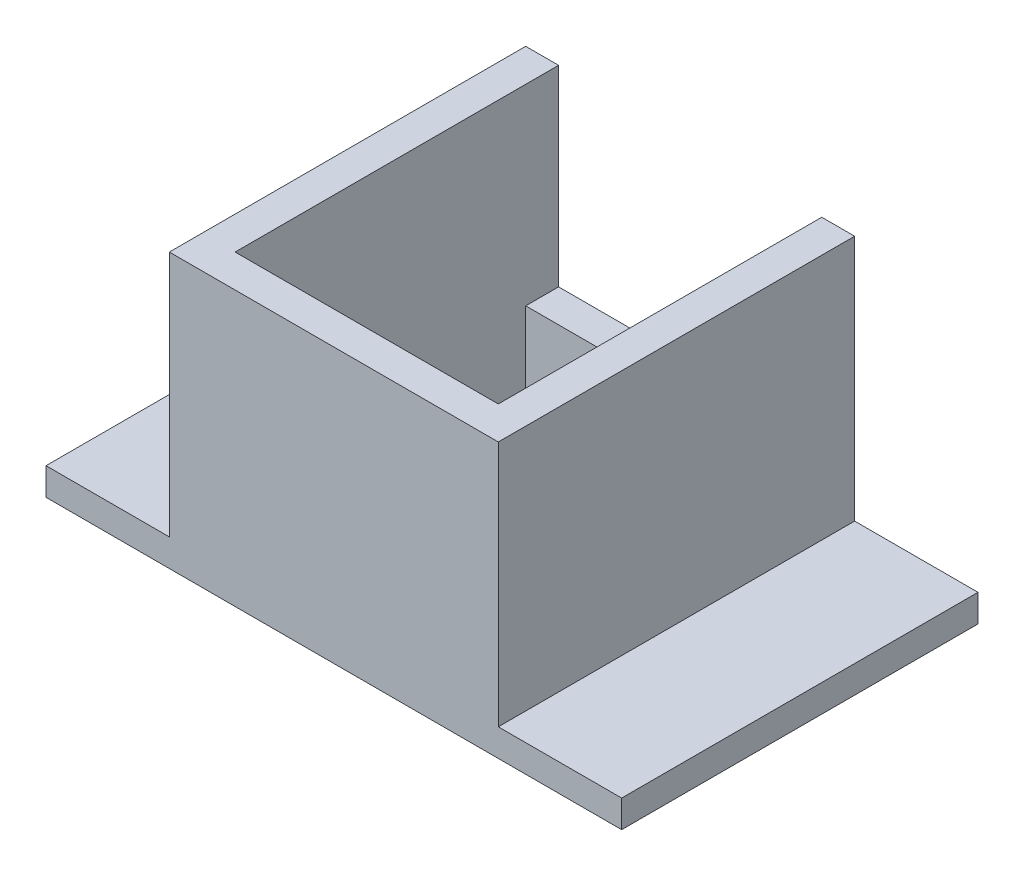
ISO-10303-21;
HEADER;
FILE_DESCRIPTION(('STEP AP214'),'2;1');
FILE_NAME('part.step','',(''),(''),'','','');
FILE_SCHEMA(('AUTOMOTIVE_DESIGN { 1 0 10303 214 1 1 1 1 }'));
ENDSEC;
DATA;
#1=APPLICATION_CONTEXT('core data for automotive mechanical design processes');
#2=APPLICATION_PROTOCOL_DEFINITION('international standard','automotive_design',2000,#1);
#3=PRODUCT_CONTEXT('',#1,'mechanical');
#4=PRODUCT('Part','Part','',(#3));
#5=PRODUCT_RELATED_PRODUCT_CATEGORY('part','',(#4));
#6=PRODUCT_DEFINITION_FORMATION('','',#4);
#7=PRODUCT_DEFINITION_CONTEXT('part definition',#1,'design');
#8=PRODUCT_DEFINITION('design','',#6,#7);
#9=PRODUCT_DEFINITION_SHAPE('','',#8);
#10=(LENGTH_UNIT() NAMED_UNIT(*) SI_UNIT(.MILLI.,.METRE.));
#11=(NAMED_UNIT(*) PLANE_ANGLE_UNIT() SI_UNIT($,.RADIAN.));
#12=(NAMED_UNIT(*) SI_UNIT($,.STERADIAN.) SOLID_ANGLE_UNIT());
#13=UNCERTAINTY_MEASURE_WITH_UNIT(LENGTH_MEASURE(1.E-05),#10,'distance_accuracy_value','');
#14=(GEOMETRIC_REPRESENTATION_CONTEXT(3) GLOBAL_UNCERTAINTY_ASSIGNED_CONTEXT((#13)) GLOBAL_UNIT_ASSIGNED_CONTEXT((#10,
#11,#12)) REPRESENTATION_CONTEXT('',''));
#15=CARTESIAN_POINT('',(0.,0.,0.));
#16=DIRECTION('',(0.,0.,1.));
#17=DIRECTION('',(1.,0.,0.));
#18=AXIS2_PLACEMENT_3D('',#15,#16,#17);
#19=CARTESIAN_POINT('',(-4.8,10.,-5.3));
#20=DIRECTION('',(0.,0.,1.));
#21=DIRECTION('',(1.,0.,0.));
#22=AXIS2_PLACEMENT_3D('',#19,#20,#21);
#23=PLANE('',#22);
#24=DIRECTION('',(0.,-1.,0.));
#25=VECTOR('',#24,1.);
#26=CARTESIAN_POINT('',(4.8,10.,-5.3));
#27=LINE('',#26,#25);
#28=CARTESIAN_POINT('',(4.8,3.,-5.3));
#29=VERTEX_POINT('',#28);
#30=CARTESIAN_POINT('',(4.8,0.,-5.3));
#31=VERTEX_POINT('',#30);
#32=EDGE_CURVE('E204',#29,#31,#27,.T.);
#33=ORIENTED_EDGE('',*,*,#32,.F.);
#34=DIRECTION('',(1.,0.,0.));
#35=VECTOR('',#34,1.);
#36=CARTESIAN_POINT('',(-4.8,3.,-5.3));
#37=LINE('',#36,#35);
#38=CARTESIAN_POINT('',(-4.8,3.,-5.3));
#39=VERTEX_POINT('',#38);
#40=EDGE_CURVE('E48',#39,#29,#37,.T.);
#41=ORIENTED_EDGE('',*,*,#40,.F.);
#42=DIRECTION('',(0.,-1.,0.));
#43=VECTOR('',#42,1.);
#44=CARTESIAN_POINT('',(-4.8,10.,-5.3));
#45=LINE('',#44,#43);
#46=CARTESIAN_POINT('',(-4.8,0.,-5.3));
#47=VERTEX_POINT('',#46);
#48=EDGE_CURVE('E220',#39,#47,#45,.T.);
#49=ORIENTED_EDGE('',*,*,#48,.T.);
#50=DIRECTION('',(-1.,0.,0.));
#51=VECTOR('',#50,1.);
#52=CARTESIAN_POINT('',(-4.8,0.,-5.3));
#53=LINE('',#52,#51);
#54=EDGE_CURVE('E196',#31,#47,#53,.T.);
#55=ORIENTED_EDGE('',*,*,#54,.F.);
#56=EDGE_LOOP('',(#33,#41,#49,#55));
#57=FACE_BOUND('',#56,.T.);
#58=ADVANCED_FACE('F33',(#57),#23,.T.);
#59=CARTESIAN_POINT('',(6.,10.,-6.5));
#60=DIRECTION('',(-1.,0.,0.));
#61=DIRECTION('',(0.,0.,1.));
#62=AXIS2_PLACEMENT_3D('',#59,#60,#61);
#63=PLANE('',#62);
#64=DIRECTION('',(0.,0.,1.));
#65=VECTOR('',#64,1.);
#66=CARTESIAN_POINT('',(6.,1.,-6.5));
#67=LINE('',#66,#65);
#68=CARTESIAN_POINT('',(6.,0.999999999999999,-6.5));
#69=VERTEX_POINT('',#68);
#70=CARTESIAN_POINT('',(6.,1.,6.5));
#71=VERTEX_POINT('',#70);
#72=EDGE_CURVE('E56',#69,#71,#67,.T.);
#73=ORIENTED_EDGE('',*,*,#72,.F.);
#74=DIRECTION('',(0.,-1.,0.));
#75=VECTOR('',#74,1.);
#76=CARTESIAN_POINT('',(6.,10.,-6.5));
#77=LINE('',#76,#75);
#78=CARTESIAN_POINT('',(6.,10.,-6.5));
#79=VERTEX_POINT('',#78);
#80=EDGE_CURVE('E11',#79,#69,#77,.T.);
#81=ORIENTED_EDGE('',*,*,#80,.F.);
#82=DIRECTION('',(0.,0.,-1.));
#83=VECTOR('',#82,1.);
#84=CARTESIAN_POINT('',(6.,10.,-6.5));
#85=LINE('',#84,#83);
#86=CARTESIAN_POINT('',(6.,10.,6.5));
#87=VERTEX_POINT('',#86);
#88=EDGE_CURVE('E223',#87,#79,#85,.T.);
#89=ORIENTED_EDGE('',*,*,#88,.F.);
#90=DIRECTION('',(0.,-1.,0.));
#91=VECTOR('',#90,1.);
#92=CARTESIAN_POINT('',(6.,10.,6.5));
#93=LINE('',#92,#91);
#94=EDGE_CURVE('E234',#87,#71,#93,.T.);
#95=ORIENTED_EDGE('',*,*,#94,.T.);
#96=EDGE_LOOP('',(#73,#81,#89,#95));
#97=FACE_BOUND('',#96,.T.);
#98=ADVANCED_FACE('F35',(#97),#63,.F.);
#99=CARTESIAN_POINT('',(-6.,10.,-6.5));
#100=DIRECTION('',(1.,0.,0.));
#101=DIRECTION('',(0.,0.,-1.));
#102=AXIS2_PLACEMENT_3D('',#99,#100,#101);
#103=PLANE('',#102);
#104=DIRECTION('',(0.,0.,-1.));
#105=VECTOR('',#104,1.);
#106=CARTESIAN_POINT('',(-6.,1.,-6.5));
#107=LINE('',#106,#105);
#108=CARTESIAN_POINT('',(-6.,0.999999999999999,6.5));
#109=VERTEX_POINT('',#108);
#110=CARTESIAN_POINT('',(-6.,1.,-6.5));
#111=VERTEX_POINT('',#110);
#112=EDGE_CURVE('E178',#109,#111,#107,.T.);
#113=ORIENTED_EDGE('',*,*,#112,.F.);
#114=DIRECTION('',(0.,-1.,0.));
#115=VECTOR('',#114,1.);
#116=CARTESIAN_POINT('',(-6.,10.,6.5));
#117=LINE('',#116,#115);
#118=CARTESIAN_POINT('',(-6.,10.,6.5));
#119=VERTEX_POINT('',#118);
#120=EDGE_CURVE('E238',#119,#109,#117,.T.);
#121=ORIENTED_EDGE('',*,*,#120,.F.);
#122=DIRECTION('',(0.,0.,1.));
#123=VECTOR('',#122,1.);
#124=CARTESIAN_POINT('',(-6.,10.,-6.5));
#125=LINE('',#124,#123);
#126=CARTESIAN_POINT('',(-6.,10.,-6.5));
#127=VERTEX_POINT('',#126);
#128=EDGE_CURVE('E230',#127,#119,#125,.T.);
#129=ORIENTED_EDGE('',*,*,#128,.F.);
#130=DIRECTION('',(0.,-1.,0.));
#131=VECTOR('',#130,1.);
#132=CARTESIAN_POINT('',(-6.,10.,-6.5));
#133=LINE('',#132,#131);
#134=EDGE_CURVE('E41',#127,#111,#133,.T.);
#135=ORIENTED_EDGE('',*,*,#134,.T.);
#136=EDGE_LOOP('',(#113,#121,#129,#135));
#137=FACE_BOUND('',#136,.T.);
#138=ADVANCED_FACE('F244',(#137),#103,.F.);
#139=CARTESIAN_POINT('',(0.,10.,0.));
#140=DIRECTION('',(0.,1.,0.));
#141=DIRECTION('',(0.,0.,1.));
#142=AXIS2_PLACEMENT_3D('',#139,#140,#141);
#143=PLANE('',#142);
#144=DIRECTION('',(0.,0.,1.));
#145=VECTOR('',#144,1.);
#146=CARTESIAN_POINT('',(-4.8,10.,-5.3));
#147=LINE('',#146,#145);
#148=CARTESIAN_POINT('',(-4.8,10.,-6.5));
#149=VERTEX_POINT('',#148);
#150=CARTESIAN_POINT('',(-4.8,10.,5.3));
#151=VERTEX_POINT('',#150);
#152=EDGE_CURVE('E197',#149,#151,#147,.T.);
#153=ORIENTED_EDGE('',*,*,#152,.F.);
#154=DIRECTION('',(-1.,0.,0.));
#155=VECTOR('',#154,1.);
#156=CARTESIAN_POINT('',(-6.,10.,-6.5));
#157=LINE('',#156,#155);
#158=EDGE_CURVE('E226',#149,#127,#157,.T.);
#159=ORIENTED_EDGE('',*,*,#158,.T.);
#160=ORIENTED_EDGE('',*,*,#128,.T.);
#161=DIRECTION('',(1.,0.,0.));
#162=VECTOR('',#161,1.);
#163=CARTESIAN_POINT('',(-6.,10.,6.5));
#164=LINE('',#163,#162);
#165=EDGE_CURVE('E232',#119,#87,#164,.T.);
#166=ORIENTED_EDGE('',*,*,#165,.T.);
#167=ORIENTED_EDGE('',*,*,#88,.T.);
#168=CARTESIAN_POINT('',(4.8,10.,-6.5));
#169=VERTEX_POINT('',#168);
#170=EDGE_CURVE('E228',#79,#169,#157,.T.);
#171=ORIENTED_EDGE('',*,*,#170,.T.);
#172=DIRECTION('',(0.,0.,-1.));
#173=VECTOR('',#172,1.);
#174=CARTESIAN_POINT('',(4.8,10.,-5.3));
#175=LINE('',#174,#173);
#176=CARTESIAN_POINT('',(4.80000000000001,10.,5.3));
#177=VERTEX_POINT('',#176);
#178=EDGE_CURVE('E140',#177,#169,#175,.T.);
#179=ORIENTED_EDGE('',*,*,#178,.F.);
#180=DIRECTION('',(1.,0.,0.));
#181=VECTOR('',#180,1.);
#182=CARTESIAN_POINT('',(-4.8,10.,5.3));
#183=LINE('',#182,#181);
#184=EDGE_CURVE('E199',#151,#177,#183,.T.);
#185=ORIENTED_EDGE('',*,*,#184,.F.);
#186=EDGE_LOOP('',(#153,#159,#160,#166,#167,#171,#179,#185));
#187=FACE_BOUND('',#186,.T.);
#188=ADVANCED_FACE('F259',(#187),#143,.T.);
#189=CARTESIAN_POINT('',(0.,0.,0.));
#190=DIRECTION('',(0.,1.,0.));
#191=DIRECTION('',(0.,0.,1.));
#192=AXIS2_PLACEMENT_3D('',#189,#190,#191);
#193=PLANE('',#192);
#194=DIRECTION('',(-1.,0.,0.));
#195=VECTOR('',#194,1.);
#196=CARTESIAN_POINT('',(-6.,0.,-6.5));
#197=LINE('',#196,#195);
#198=CARTESIAN_POINT('',(10.5,0.,-6.5));
#199=VERTEX_POINT('',#198);
#200=CARTESIAN_POINT('',(-10.5,0.,-6.5));
#201=VERTEX_POINT('',#200);
#202=EDGE_CURVE('E222',#199,#201,#197,.T.);
#203=ORIENTED_EDGE('',*,*,#202,.F.);
#204=DIRECTION('',(0.,0.,-1.));
#205=VECTOR('',#204,1.);
#206=CARTESIAN_POINT('',(10.5,0.,6.5));
#207=LINE('',#206,#205);
#208=CARTESIAN_POINT('',(10.5,0.,6.5));
#209=VERTEX_POINT('',#208);
#210=EDGE_CURVE('E159',#209,#199,#207,.T.);
#211=ORIENTED_EDGE('',*,*,#210,.F.);
#212=DIRECTION('',(1.,0.,0.));
#213=VECTOR('',#212,1.);
#214=CARTESIAN_POINT('',(-6.,0.,6.5));
#215=LINE('',#214,#213);
#216=CARTESIAN_POINT('',(-10.5,0.,6.5));
#217=VERTEX_POINT('',#216);
#218=EDGE_CURVE('E227',#217,#209,#215,.T.);
#219=ORIENTED_EDGE('',*,*,#218,.F.);
#220=DIRECTION('',(0.,0.,1.));
#221=VECTOR('',#220,1.);
#222=CARTESIAN_POINT('',(-10.5,0.,6.5));
#223=LINE('',#222,#221);
#224=EDGE_CURVE('E177',#201,#217,#223,.T.);
#225=ORIENTED_EDGE('',*,*,#224,.F.);
#226=EDGE_LOOP('',(#203,#211,#219,#225));
#227=FACE_BOUND('',#226,.T.);
#228=ORIENTED_EDGE('',*,*,#54,.T.);
#229=DIRECTION('',(0.,0.,1.));
#230=VECTOR('',#229,1.);
#231=CARTESIAN_POINT('',(-4.8,0.,-5.3));
#232=LINE('',#231,#230);
#233=CARTESIAN_POINT('',(-4.8,0.,5.3));
#234=VERTEX_POINT('',#233);
#235=EDGE_CURVE('E207',#47,#234,#232,.T.);
#236=ORIENTED_EDGE('',*,*,#235,.T.);
#237=DIRECTION('',(1.,0.,0.));
#238=VECTOR('',#237,1.);
#239=CARTESIAN_POINT('',(-4.8,0.,5.3));
#240=LINE('',#239,#238);
#241=CARTESIAN_POINT('',(4.80000000000001,0.,5.3));
#242=VERTEX_POINT('',#241);
#243=EDGE_CURVE('E210',#234,#242,#240,.T.);
#244=ORIENTED_EDGE('',*,*,#243,.T.);
#245=DIRECTION('',(0.,0.,-1.));
#246=VECTOR('',#245,1.);
#247=CARTESIAN_POINT('',(4.8,0.,-5.3));
#248=LINE('',#247,#246);
#249=EDGE_CURVE('E200',#242,#31,#248,.T.);
#250=ORIENTED_EDGE('',*,*,#249,.T.);
#251=EDGE_LOOP('',(#228,#236,#244,#250));
#252=FACE_BOUND('',#251,.T.);
#253=ADVANCED_FACE('F270',(#227,#252),#193,.F.);
#254=CARTESIAN_POINT('',(-6.,10.,-6.5));
#255=DIRECTION('',(0.,0.,1.));
#256=DIRECTION('',(1.,0.,0.));
#257=AXIS2_PLACEMENT_3D('',#254,#255,#256);
#258=PLANE('',#257);
#259=ORIENTED_EDGE('',*,*,#158,.F.);
#260=DIRECTION('',(0.,1.,0.));
#261=VECTOR('',#260,1.);
#262=CARTESIAN_POINT('',(-4.8,3.,-6.5));
#263=LINE('',#262,#261);
#264=CARTESIAN_POINT('',(-4.8,3.,-6.5));
#265=VERTEX_POINT('',#264);
#266=EDGE_CURVE('E144',#265,#149,#263,.T.);
#267=ORIENTED_EDGE('',*,*,#266,.F.);
#268=DIRECTION('',(-1.,0.,0.));
#269=VECTOR('',#268,1.);
#270=CARTESIAN_POINT('',(4.8,3.,-6.5));
#271=LINE('',#270,#269);
#272=CARTESIAN_POINT('',(4.8,3.,-6.5));
#273=VERTEX_POINT('',#272);
#274=EDGE_CURVE('E148',#273,#265,#271,.T.);
#275=ORIENTED_EDGE('',*,*,#274,.F.);
#276=DIRECTION('',(0.,1.,0.));
#277=VECTOR('',#276,1.);
#278=CARTESIAN_POINT('',(4.8,3.,-6.5));
#279=LINE('',#278,#277);
#280=EDGE_CURVE('E134',#273,#169,#279,.T.);
#281=ORIENTED_EDGE('',*,*,#280,.T.);
#282=ORIENTED_EDGE('',*,*,#170,.F.);
#283=ORIENTED_EDGE('',*,*,#80,.T.);
#284=DIRECTION('',(-1.,0.,0.));
#285=VECTOR('',#284,1.);
#286=CARTESIAN_POINT('',(6.,1.,-6.5));
#287=LINE('',#286,#285);
#288=CARTESIAN_POINT('',(10.5,1.,-6.5));
#289=VERTEX_POINT('',#288);
#290=EDGE_CURVE('E166',#289,#69,#287,.T.);
#291=ORIENTED_EDGE('',*,*,#290,.F.);
#292=DIRECTION('',(0.,-1.,0.));
#293=VECTOR('',#292,1.);
#294=CARTESIAN_POINT('',(10.5,1.,-6.5));
#295=LINE('',#294,#293);
#296=EDGE_CURVE('E169',#289,#199,#295,.T.);
#297=ORIENTED_EDGE('',*,*,#296,.T.);
#298=ORIENTED_EDGE('',*,*,#202,.T.);
#299=DIRECTION('',(0.,-1.,0.));
#300=VECTOR('',#299,1.);
#301=CARTESIAN_POINT('',(-10.5,1.,-6.5));
#302=LINE('',#301,#300);
#303=CARTESIAN_POINT('',(-10.5,1.,-6.5));
#304=VERTEX_POINT('',#303);
#305=EDGE_CURVE('E193',#304,#201,#302,.T.);
#306=ORIENTED_EDGE('',*,*,#305,.F.);
#307=DIRECTION('',(-1.,0.,0.));
#308=VECTOR('',#307,1.);
#309=CARTESIAN_POINT('',(-6.,1.,-6.5));
#310=LINE('',#309,#308);
#311=EDGE_CURVE('E181',#111,#304,#310,.T.);
#312=ORIENTED_EDGE('',*,*,#311,.F.);
#313=ORIENTED_EDGE('',*,*,#134,.F.);
#314=EDGE_LOOP('',(#259,#267,#275,#281,#282,#283,#291,#297,#298,#306,#312,#313));
#315=FACE_BOUND('',#314,.T.);
#316=ADVANCED_FACE('F153',(#315),#258,.F.);
#317=CARTESIAN_POINT('',(-6.,10.,6.5));
#318=DIRECTION('',(0.,0.,-1.));
#319=DIRECTION('',(-1.,0.,0.));
#320=AXIS2_PLACEMENT_3D('',#317,#318,#319);
#321=PLANE('',#320);
#322=ORIENTED_EDGE('',*,*,#218,.T.);
#323=DIRECTION('',(0.,-1.,0.));
#324=VECTOR('',#323,1.);
#325=CARTESIAN_POINT('',(10.5,1.,6.5));
#326=LINE('',#325,#324);
#327=CARTESIAN_POINT('',(10.5,1.,6.5));
#328=VERTEX_POINT('',#327);
#329=EDGE_CURVE('E174',#328,#209,#326,.T.);
#330=ORIENTED_EDGE('',*,*,#329,.F.);
#331=DIRECTION('',(1.,0.,0.));
#332=VECTOR('',#331,1.);
#333=CARTESIAN_POINT('',(6.,1.,6.5));
#334=LINE('',#333,#332);
#335=EDGE_CURVE('E162',#71,#328,#334,.T.);
#336=ORIENTED_EDGE('',*,*,#335,.F.);
#337=ORIENTED_EDGE('',*,*,#94,.F.);
#338=ORIENTED_EDGE('',*,*,#165,.F.);
#339=ORIENTED_EDGE('',*,*,#120,.T.);
#340=DIRECTION('',(1.,0.,0.));
#341=VECTOR('',#340,1.);
#342=CARTESIAN_POINT('',(-6.,1.,6.5));
#343=LINE('',#342,#341);
#344=CARTESIAN_POINT('',(-10.5,1.,6.5));
#345=VERTEX_POINT('',#344);
#346=EDGE_CURVE('E185',#345,#109,#343,.T.);
#347=ORIENTED_EDGE('',*,*,#346,.F.);
#348=DIRECTION('',(0.,-1.,0.));
#349=VECTOR('',#348,1.);
#350=CARTESIAN_POINT('',(-10.5,1.,6.5));
#351=LINE('',#350,#349);
#352=EDGE_CURVE('E188',#345,#217,#351,.T.);
#353=ORIENTED_EDGE('',*,*,#352,.T.);
#354=EDGE_LOOP('',(#322,#330,#336,#337,#338,#339,#347,#353));
#355=FACE_BOUND('',#354,.T.);
#356=ADVANCED_FACE('F253',(#355),#321,.F.);
#357=CARTESIAN_POINT('',(-4.8,10.,-5.3));
#358=DIRECTION('',(1.,0.,0.));
#359=DIRECTION('',(0.,0.,-1.));
#360=AXIS2_PLACEMENT_3D('',#357,#358,#359);
#361=PLANE('',#360);
#362=ORIENTED_EDGE('',*,*,#235,.F.);
#363=ORIENTED_EDGE('',*,*,#48,.F.);
#364=DIRECTION('',(0.,0.,1.));
#365=VECTOR('',#364,1.);
#366=CARTESIAN_POINT('',(-4.8,3.,-5.3));
#367=LINE('',#366,#365);
#368=EDGE_CURVE('E145',#265,#39,#367,.T.);
#369=ORIENTED_EDGE('',*,*,#368,.F.);
#370=ORIENTED_EDGE('',*,*,#266,.T.);
#371=ORIENTED_EDGE('',*,*,#152,.T.);
#372=DIRECTION('',(0.,-1.,0.));
#373=VECTOR('',#372,1.);
#374=CARTESIAN_POINT('',(-4.8,10.,5.3));
#375=LINE('',#374,#373);
#376=EDGE_CURVE('E218',#151,#234,#375,.T.);
#377=ORIENTED_EDGE('',*,*,#376,.T.);
#378=EDGE_LOOP('',(#362,#363,#369,#370,#371,#377));
#379=FACE_BOUND('',#378,.T.);
#380=ADVANCED_FACE('F264',(#379),#361,.T.);
#381=CARTESIAN_POINT('',(-4.8,10.,5.3));
#382=DIRECTION('',(0.,0.,-1.));
#383=DIRECTION('',(-1.,0.,0.));
#384=AXIS2_PLACEMENT_3D('',#381,#382,#383);
#385=PLANE('',#384);
#386=ORIENTED_EDGE('',*,*,#243,.F.);
#387=ORIENTED_EDGE('',*,*,#376,.F.);
#388=ORIENTED_EDGE('',*,*,#184,.T.);
#389=DIRECTION('',(0.,-1.,0.));
#390=VECTOR('',#389,1.);
#391=CARTESIAN_POINT('',(4.80000000000001,10.,5.3));
#392=LINE('',#391,#390);
#393=EDGE_CURVE('E216',#177,#242,#392,.T.);
#394=ORIENTED_EDGE('',*,*,#393,.T.);
#395=EDGE_LOOP('',(#386,#387,#388,#394));
#396=FACE_BOUND('',#395,.T.);
#397=ADVANCED_FACE('F272',(#396),#385,.T.);
#398=CARTESIAN_POINT('',(4.8,10.,-5.3));
#399=DIRECTION('',(-1.,0.,0.));
#400=DIRECTION('',(0.,0.,1.));
#401=AXIS2_PLACEMENT_3D('',#398,#399,#400);
#402=PLANE('',#401);
#403=ORIENTED_EDGE('',*,*,#249,.F.);
#404=ORIENTED_EDGE('',*,*,#393,.F.);
#405=ORIENTED_EDGE('',*,*,#178,.T.);
#406=ORIENTED_EDGE('',*,*,#280,.F.);
#407=DIRECTION('',(0.,0.,-1.));
#408=VECTOR('',#407,1.);
#409=CARTESIAN_POINT('',(4.8,3.,-5.3));
#410=LINE('',#409,#408);
#411=EDGE_CURVE('E137',#29,#273,#410,.T.);
#412=ORIENTED_EDGE('',*,*,#411,.F.);
#413=ORIENTED_EDGE('',*,*,#32,.T.);
#414=EDGE_LOOP('',(#403,#404,#405,#406,#412,#413));
#415=FACE_BOUND('',#414,.T.);
#416=ADVANCED_FACE('F136',(#415),#402,.T.);
#417=CARTESIAN_POINT('',(-10.5,1.,6.5));
#418=DIRECTION('',(1.,0.,0.));
#419=DIRECTION('',(0.,0.,-1.));
#420=AXIS2_PLACEMENT_3D('',#417,#418,#419);
#421=PLANE('',#420);
#422=ORIENTED_EDGE('',*,*,#224,.T.);
#423=ORIENTED_EDGE('',*,*,#352,.F.);
#424=DIRECTION('',(0.,0.,1.));
#425=VECTOR('',#424,1.);
#426=CARTESIAN_POINT('',(-10.5,1.,6.5));
#427=LINE('',#426,#425);
#428=EDGE_CURVE('E183',#304,#345,#427,.T.);
#429=ORIENTED_EDGE('',*,*,#428,.F.);
#430=ORIENTED_EDGE('',*,*,#305,.T.);
#431=EDGE_LOOP('',(#422,#423,#429,#430));
#432=FACE_BOUND('',#431,.T.);
#433=ADVANCED_FACE('F285',(#432),#421,.F.);
#434=CARTESIAN_POINT('',(0.,1.,0.));
#435=DIRECTION('',(0.,-1.,0.));
#436=DIRECTION('',(0.,0.,-1.));
#437=AXIS2_PLACEMENT_3D('',#434,#435,#436);
#438=PLANE('',#437);
#439=ORIENTED_EDGE('',*,*,#112,.T.);
#440=ORIENTED_EDGE('',*,*,#311,.T.);
#441=ORIENTED_EDGE('',*,*,#428,.T.);
#442=ORIENTED_EDGE('',*,*,#346,.T.);
#443=EDGE_LOOP('',(#439,#440,#441,#442));
#444=FACE_BOUND('',#443,.T.);
#445=ADVANCED_FACE('F249',(#444),#438,.F.);
#446=CARTESIAN_POINT('',(10.5,1.,6.5));
#447=DIRECTION('',(-1.,0.,0.));
#448=DIRECTION('',(0.,0.,1.));
#449=AXIS2_PLACEMENT_3D('',#446,#447,#448);
#450=PLANE('',#449);
#451=ORIENTED_EDGE('',*,*,#210,.T.);
#452=ORIENTED_EDGE('',*,*,#296,.F.);
#453=DIRECTION('',(0.,0.,-1.));
#454=VECTOR('',#453,1.);
#455=CARTESIAN_POINT('',(10.5,1.,6.5));
#456=LINE('',#455,#454);
#457=EDGE_CURVE('E164',#328,#289,#456,.T.);
#458=ORIENTED_EDGE('',*,*,#457,.F.);
#459=ORIENTED_EDGE('',*,*,#329,.T.);
#460=EDGE_LOOP('',(#451,#452,#458,#459));
#461=FACE_BOUND('',#460,.T.);
#462=ADVANCED_FACE('F280',(#461),#450,.F.);
#463=CARTESIAN_POINT('',(0.,1.,0.));
#464=DIRECTION('',(0.,1.,0.));
#465=DIRECTION('',(0.,0.,1.));
#466=AXIS2_PLACEMENT_3D('',#463,#464,#465);
#467=PLANE('',#466);
#468=ORIENTED_EDGE('',*,*,#72,.T.);
#469=ORIENTED_EDGE('',*,*,#335,.T.);
#470=ORIENTED_EDGE('',*,*,#457,.T.);
#471=ORIENTED_EDGE('',*,*,#290,.T.);
#472=EDGE_LOOP('',(#468,#469,#470,#471));
#473=FACE_BOUND('',#472,.T.);
#474=ADVANCED_FACE('F275',(#473),#467,.T.);
#475=CARTESIAN_POINT('',(0.,3.,0.));
#476=DIRECTION('',(0.,1.,0.));
#477=DIRECTION('',(0.,0.,1.));
#478=AXIS2_PLACEMENT_3D('',#475,#476,#477);
#479=PLANE('',#478);
#480=ORIENTED_EDGE('',*,*,#40,.T.);
#481=ORIENTED_EDGE('',*,*,#411,.T.);
#482=ORIENTED_EDGE('',*,*,#274,.T.);
#483=ORIENTED_EDGE('',*,*,#368,.T.);
#484=EDGE_LOOP('',(#480,#481,#482,#483));
#485=FACE_BOUND('',#484,.T.);
#486=ADVANCED_FACE('F147',(#485),#479,.T.);
#487=CLOSED_SHELL('',(#58,#98,#138,#188,#253,#316,#356,#380,#397,#416,#433,#445,#462,#474,#486));
#488=MANIFOLD_SOLID_BREP('B2',#487);
#489=ADVANCED_BREP_SHAPE_REPRESENTATION('',(#18,#488),#14);
#490=SHAPE_DEFINITION_REPRESENTATION(#9,#489);
ENDSEC;
END-ISO-10303-21;
